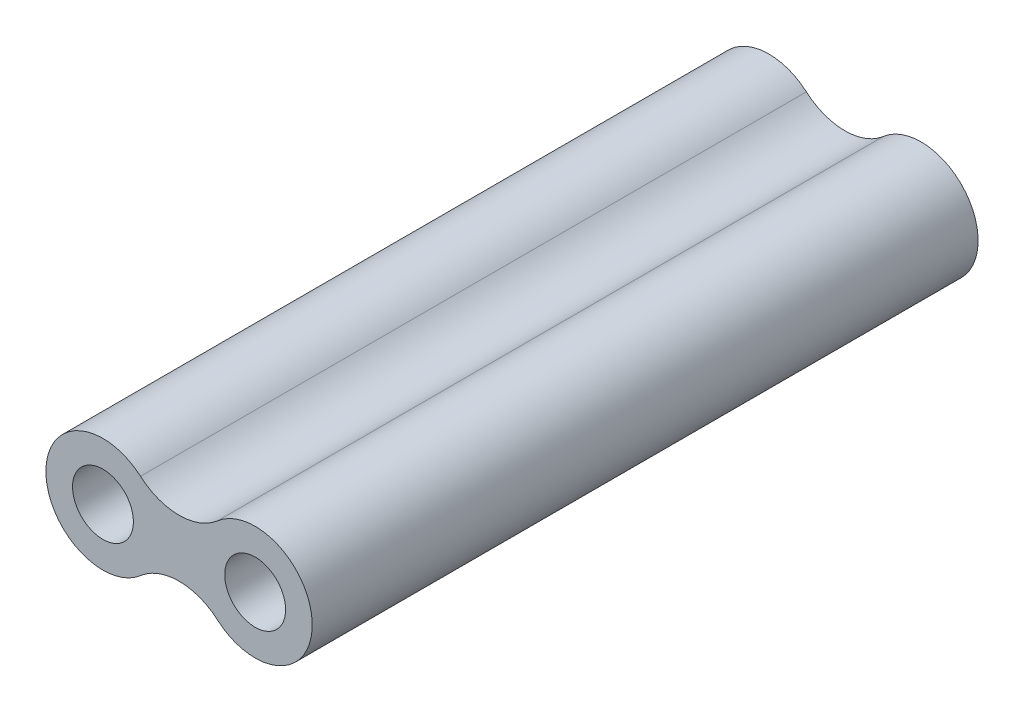
ISO-10303-21;
HEADER;
FILE_DESCRIPTION(('STEP AP214'),'2;1');
FILE_NAME('part.step','',(''),(''),'','','');
FILE_SCHEMA(('AUTOMOTIVE_DESIGN { 1 0 10303 214 1 1 1 1 }'));
ENDSEC;
DATA;
#1=APPLICATION_CONTEXT('core data for automotive mechanical design processes');
#2=APPLICATION_PROTOCOL_DEFINITION('international standard','automotive_design',2000,#1);
#3=PRODUCT_CONTEXT('',#1,'mechanical');
#4=PRODUCT('Part','Part','',(#3));
#5=PRODUCT_RELATED_PRODUCT_CATEGORY('part','',(#4));
#6=PRODUCT_DEFINITION_FORMATION('','',#4);
#7=PRODUCT_DEFINITION_CONTEXT('part definition',#1,'design');
#8=PRODUCT_DEFINITION('design','',#6,#7);
#9=PRODUCT_DEFINITION_SHAPE('','',#8);
#10=(LENGTH_UNIT() NAMED_UNIT(*) SI_UNIT(.MILLI.,.METRE.));
#11=(NAMED_UNIT(*) PLANE_ANGLE_UNIT() SI_UNIT($,.RADIAN.));
#12=(NAMED_UNIT(*) SI_UNIT($,.STERADIAN.) SOLID_ANGLE_UNIT());
#13=UNCERTAINTY_MEASURE_WITH_UNIT(LENGTH_MEASURE(1.E-05),#10,'distance_accuracy_value','');
#14=(GEOMETRIC_REPRESENTATION_CONTEXT(3) GLOBAL_UNCERTAINTY_ASSIGNED_CONTEXT((#13)) GLOBAL_UNIT_ASSIGNED_CONTEXT((#10,
#11,#12)) REPRESENTATION_CONTEXT('',''));
#15=CARTESIAN_POINT('',(0.,0.,0.));
#16=DIRECTION('',(0.,0.,1.));
#17=DIRECTION('',(1.,0.,0.));
#18=AXIS2_PLACEMENT_3D('',#15,#16,#17);
#19=CARTESIAN_POINT('',(0.,0.,17.5));
#20=DIRECTION('',(0.,0.,-1.));
#21=DIRECTION('',(-1.,0.,0.));
#22=AXIS2_PLACEMENT_3D('',#19,#20,#21);
#23=CYLINDRICAL_SURFACE('',#22,3.);
#24=CARTESIAN_POINT('',(0.,0.,17.5));
#25=DIRECTION('',(0.,0.,1.));
#26=DIRECTION('',(1.,0.,0.));
#27=AXIS2_PLACEMENT_3D('',#24,#25,#26);
#28=CIRCLE('',#27,3.);
#29=CARTESIAN_POINT('',(1.97260273972603,2.26027397260274,17.5));
#30=VERTEX_POINT('',#29);
#31=CARTESIAN_POINT('',(1.97260273972603,-2.26027397260274,17.5));
#32=VERTEX_POINT('',#31);
#33=EDGE_CURVE('E11',#30,#32,#28,.T.);
#34=ORIENTED_EDGE('',*,*,#33,.F.);
#35=DIRECTION('',(0.,0.,-1.));
#36=VECTOR('',#35,1.);
#37=CARTESIAN_POINT('',(1.97260273972603,2.26027397260274,28.3394603783953));
#38=LINE('',#37,#36);
#39=CARTESIAN_POINT('',(1.97260273972603,2.26027397260274,-17.5));
#40=VERTEX_POINT('',#39);
#41=EDGE_CURVE('E86',#30,#40,#38,.T.);
#42=ORIENTED_EDGE('',*,*,#41,.T.);
#43=CARTESIAN_POINT('',(0.,0.,-17.5));
#44=DIRECTION('',(0.,0.,1.));
#45=DIRECTION('',(1.,0.,0.));
#46=AXIS2_PLACEMENT_3D('',#43,#44,#45);
#47=CIRCLE('',#46,3.);
#48=CARTESIAN_POINT('',(1.97260273972603,-2.26027397260274,-17.5));
#49=VERTEX_POINT('',#48);
#50=EDGE_CURVE('E44',#40,#49,#47,.T.);
#51=ORIENTED_EDGE('',*,*,#50,.T.);
#52=DIRECTION('',(0.,0.,-1.));
#53=VECTOR('',#52,1.);
#54=CARTESIAN_POINT('',(1.97260273972603,-2.26027397260274,28.3394603783953));
#55=LINE('',#54,#53);
#56=EDGE_CURVE('E55',#32,#49,#55,.T.);
#57=ORIENTED_EDGE('',*,*,#56,.F.);
#58=EDGE_LOOP('',(#34,#42,#51,#57));
#59=FACE_BOUND('',#58,.T.);
#60=ADVANCED_FACE('F41',(#59),#23,.T.);
#61=CARTESIAN_POINT('',(0.,0.,17.5));
#62=DIRECTION('',(0.,0.,1.));
#63=DIRECTION('',(1.,0.,0.));
#64=AXIS2_PLACEMENT_3D('',#61,#62,#63);
#65=PLANE('',#64);
#66=CARTESIAN_POINT('',(8.,0.,17.5));
#67=DIRECTION('',(0.,0.,1.));
#68=DIRECTION('',(1.,0.,0.));
#69=AXIS2_PLACEMENT_3D('',#66,#67,#68);
#70=CIRCLE('',#69,1.6);
#71=CARTESIAN_POINT('',(9.6,0.,17.5));
#72=VERTEX_POINT('',#71);
#73=EDGE_CURVE('E98',#72,#72,#70,.T.);
#74=ORIENTED_EDGE('',*,*,#73,.F.);
#75=EDGE_LOOP('',(#74));
#76=FACE_BOUND('',#75,.T.);
#77=CARTESIAN_POINT('',(0.,0.,17.5));
#78=DIRECTION('',(0.,0.,1.));
#79=DIRECTION('',(1.,0.,0.));
#80=AXIS2_PLACEMENT_3D('',#77,#78,#79);
#81=CIRCLE('',#80,1.6);
#82=CARTESIAN_POINT('',(1.6,0.,17.5));
#83=VERTEX_POINT('',#82);
#84=EDGE_CURVE('E108',#83,#83,#81,.T.);
#85=ORIENTED_EDGE('',*,*,#84,.F.);
#86=EDGE_LOOP('',(#85));
#87=FACE_BOUND('',#86,.T.);
#88=ORIENTED_EDGE('',*,*,#33,.T.);
#89=CARTESIAN_POINT('',(4.,-4.58333333333334,17.5));
#90=DIRECTION('',(0.,0.,1.));
#91=DIRECTION('',(1.,0.,0.));
#92=AXIS2_PLACEMENT_3D('',#89,#90,#91);
#93=CIRCLE('',#92,3.08333333333333);
#94=CARTESIAN_POINT('',(6.02739726027397,-2.26027397260274,17.5));
#95=VERTEX_POINT('',#94);
#96=EDGE_CURVE('E109',#32,#95,#93,.F.);
#97=ORIENTED_EDGE('',*,*,#96,.T.);
#98=CARTESIAN_POINT('',(8.,0.,17.5));
#99=DIRECTION('',(0.,0.,1.));
#100=DIRECTION('',(1.,0.,0.));
#101=AXIS2_PLACEMENT_3D('',#98,#99,#100);
#102=CIRCLE('',#101,3.);
#103=CARTESIAN_POINT('',(6.02739726027397,2.26027397260274,17.5));
#104=VERTEX_POINT('',#103);
#105=EDGE_CURVE('E105',#95,#104,#102,.T.);
#106=ORIENTED_EDGE('',*,*,#105,.T.);
#107=CARTESIAN_POINT('',(4.,4.58333333333334,17.5));
#108=DIRECTION('',(0.,0.,1.));
#109=DIRECTION('',(1.,0.,0.));
#110=AXIS2_PLACEMENT_3D('',#107,#108,#109);
#111=CIRCLE('',#110,3.08333333333333);
#112=EDGE_CURVE('E102',#30,#104,#111,.T.);
#113=ORIENTED_EDGE('',*,*,#112,.F.);
#114=EDGE_LOOP('',(#88,#97,#106,#113));
#115=FACE_BOUND('',#114,.T.);
#116=ADVANCED_FACE('F128',(#76,#87,#115),#65,.T.);
#117=CARTESIAN_POINT('',(0.,0.,-17.5));
#118=DIRECTION('',(0.,0.,1.));
#119=DIRECTION('',(1.,0.,0.));
#120=AXIS2_PLACEMENT_3D('',#117,#118,#119);
#121=PLANE('',#120);
#122=CARTESIAN_POINT('',(8.,0.,-17.5));
#123=DIRECTION('',(0.,0.,1.));
#124=DIRECTION('',(1.,0.,0.));
#125=AXIS2_PLACEMENT_3D('',#122,#123,#124);
#126=CIRCLE('',#125,1.59999999999999);
#127=CARTESIAN_POINT('',(9.59999999999999,0.,-17.5));
#128=VERTEX_POINT('',#127);
#129=EDGE_CURVE('E93',#128,#128,#126,.T.);
#130=ORIENTED_EDGE('',*,*,#129,.T.);
#131=EDGE_LOOP('',(#130));
#132=FACE_BOUND('',#131,.T.);
#133=CARTESIAN_POINT('',(0.,0.,-17.5));
#134=DIRECTION('',(0.,0.,1.));
#135=DIRECTION('',(1.,0.,0.));
#136=AXIS2_PLACEMENT_3D('',#133,#134,#135);
#137=CIRCLE('',#136,1.59999999999999);
#138=CARTESIAN_POINT('',(1.59999999999999,0.,-17.5));
#139=VERTEX_POINT('',#138);
#140=EDGE_CURVE('E85',#139,#139,#137,.T.);
#141=ORIENTED_EDGE('',*,*,#140,.T.);
#142=EDGE_LOOP('',(#141));
#143=FACE_BOUND('',#142,.T.);
#144=ORIENTED_EDGE('',*,*,#50,.F.);
#145=CARTESIAN_POINT('',(4.,4.58333333333334,-17.5));
#146=DIRECTION('',(0.,0.,1.));
#147=DIRECTION('',(1.,0.,0.));
#148=AXIS2_PLACEMENT_3D('',#145,#146,#147);
#149=CIRCLE('',#148,3.08333333333333);
#150=CARTESIAN_POINT('',(6.02739726027397,2.26027397260274,-17.5));
#151=VERTEX_POINT('',#150);
#152=EDGE_CURVE('E81',#151,#40,#149,.F.);
#153=ORIENTED_EDGE('',*,*,#152,.F.);
#154=CARTESIAN_POINT('',(8.,0.,-17.5));
#155=DIRECTION('',(0.,0.,1.));
#156=DIRECTION('',(1.,0.,0.));
#157=AXIS2_PLACEMENT_3D('',#154,#155,#156);
#158=CIRCLE('',#157,3.);
#159=CARTESIAN_POINT('',(6.02739726027397,-2.26027397260274,-17.5));
#160=VERTEX_POINT('',#159);
#161=EDGE_CURVE('E95',#151,#160,#158,.F.);
#162=ORIENTED_EDGE('',*,*,#161,.T.);
#163=CARTESIAN_POINT('',(4.,-4.58333333333334,-17.5));
#164=DIRECTION('',(0.,0.,1.));
#165=DIRECTION('',(1.,0.,0.));
#166=AXIS2_PLACEMENT_3D('',#163,#164,#165);
#167=CIRCLE('',#166,3.08333333333333);
#168=EDGE_CURVE('E84',#160,#49,#167,.T.);
#169=ORIENTED_EDGE('',*,*,#168,.T.);
#170=EDGE_LOOP('',(#144,#153,#162,#169));
#171=FACE_BOUND('',#170,.T.);
#172=ADVANCED_FACE('F78',(#132,#143,#171),#121,.F.);
#173=CARTESIAN_POINT('',(0.,0.,17.5));
#174=DIRECTION('',(0.,0.,1.));
#175=DIRECTION('',(1.,0.,0.));
#176=AXIS2_PLACEMENT_3D('',#173,#174,#175);
#177=CYLINDRICAL_SURFACE('',#176,1.59999999999999);
#178=ORIENTED_EDGE('',*,*,#140,.F.);
#179=EDGE_LOOP('',(#178));
#180=FACE_BOUND('',#179,.T.);
#181=ORIENTED_EDGE('',*,*,#84,.T.);
#182=EDGE_LOOP('',(#181));
#183=FACE_BOUND('',#182,.T.);
#184=ADVANCED_FACE('F121',(#180,#183),#177,.F.);
#185=CARTESIAN_POINT('',(8.,0.,28.3394603783953));
#186=DIRECTION('',(0.,0.,-1.));
#187=DIRECTION('',(-1.,0.,0.));
#188=AXIS2_PLACEMENT_3D('',#185,#186,#187);
#189=CYLINDRICAL_SURFACE('',#188,3.);
#190=ORIENTED_EDGE('',*,*,#105,.F.);
#191=DIRECTION('',(0.,0.,-1.));
#192=VECTOR('',#191,1.);
#193=CARTESIAN_POINT('',(6.02739726027397,-2.26027397260274,28.3394603783953));
#194=LINE('',#193,#192);
#195=EDGE_CURVE('E104',#95,#160,#194,.T.);
#196=ORIENTED_EDGE('',*,*,#195,.T.);
#197=ORIENTED_EDGE('',*,*,#161,.F.);
#198=DIRECTION('',(0.,0.,-1.));
#199=VECTOR('',#198,1.);
#200=CARTESIAN_POINT('',(6.02739726027397,2.26027397260274,28.3394603783953));
#201=LINE('',#200,#199);
#202=EDGE_CURVE('E89',#104,#151,#201,.T.);
#203=ORIENTED_EDGE('',*,*,#202,.F.);
#204=EDGE_LOOP('',(#190,#196,#197,#203));
#205=FACE_BOUND('',#204,.T.);
#206=ADVANCED_FACE('F124',(#205),#189,.T.);
#207=CARTESIAN_POINT('',(4.,4.58333333333334,28.3394603783953));
#208=DIRECTION('',(0.,0.,-1.));
#209=DIRECTION('',(-1.,0.,0.));
#210=AXIS2_PLACEMENT_3D('',#207,#208,#209);
#211=CYLINDRICAL_SURFACE('',#210,3.08333333333333);
#212=ORIENTED_EDGE('',*,*,#41,.F.);
#213=ORIENTED_EDGE('',*,*,#112,.T.);
#214=ORIENTED_EDGE('',*,*,#202,.T.);
#215=ORIENTED_EDGE('',*,*,#152,.T.);
#216=EDGE_LOOP('',(#212,#213,#214,#215));
#217=FACE_BOUND('',#216,.T.);
#218=ADVANCED_FACE('F91',(#217),#211,.F.);
#219=CARTESIAN_POINT('',(4.,-4.58333333333334,28.3394603783953));
#220=DIRECTION('',(0.,0.,-1.));
#221=DIRECTION('',(-1.,0.,0.));
#222=AXIS2_PLACEMENT_3D('',#219,#220,#221);
#223=CYLINDRICAL_SURFACE('',#222,3.08333333333333);
#224=ORIENTED_EDGE('',*,*,#96,.F.);
#225=ORIENTED_EDGE('',*,*,#56,.T.);
#226=ORIENTED_EDGE('',*,*,#168,.F.);
#227=ORIENTED_EDGE('',*,*,#195,.F.);
#228=EDGE_LOOP('',(#224,#225,#226,#227));
#229=FACE_BOUND('',#228,.T.);
#230=ADVANCED_FACE('F135',(#229),#223,.F.);
#231=CARTESIAN_POINT('',(8.,0.,17.5));
#232=DIRECTION('',(0.,0.,1.));
#233=DIRECTION('',(1.,0.,0.));
#234=AXIS2_PLACEMENT_3D('',#231,#232,#233);
#235=CYLINDRICAL_SURFACE('',#234,1.59999999999999);
#236=ORIENTED_EDGE('',*,*,#129,.F.);
#237=EDGE_LOOP('',(#236));
#238=FACE_BOUND('',#237,.T.);
#239=ORIENTED_EDGE('',*,*,#73,.T.);
#240=EDGE_LOOP('',(#239));
#241=FACE_BOUND('',#240,.T.);
#242=ADVANCED_FACE('F191',(#238,#241),#235,.F.);
#243=CLOSED_SHELL('',(#60,#116,#172,#184,#206,#218,#230,#242));
#244=MANIFOLD_SOLID_BREP('B2',#243);
#245=ADVANCED_BREP_SHAPE_REPRESENTATION('',(#18,#244),#14);
#246=SHAPE_DEFINITION_REPRESENTATION(#9,#245);
ENDSEC;
END-ISO-10303-21;
